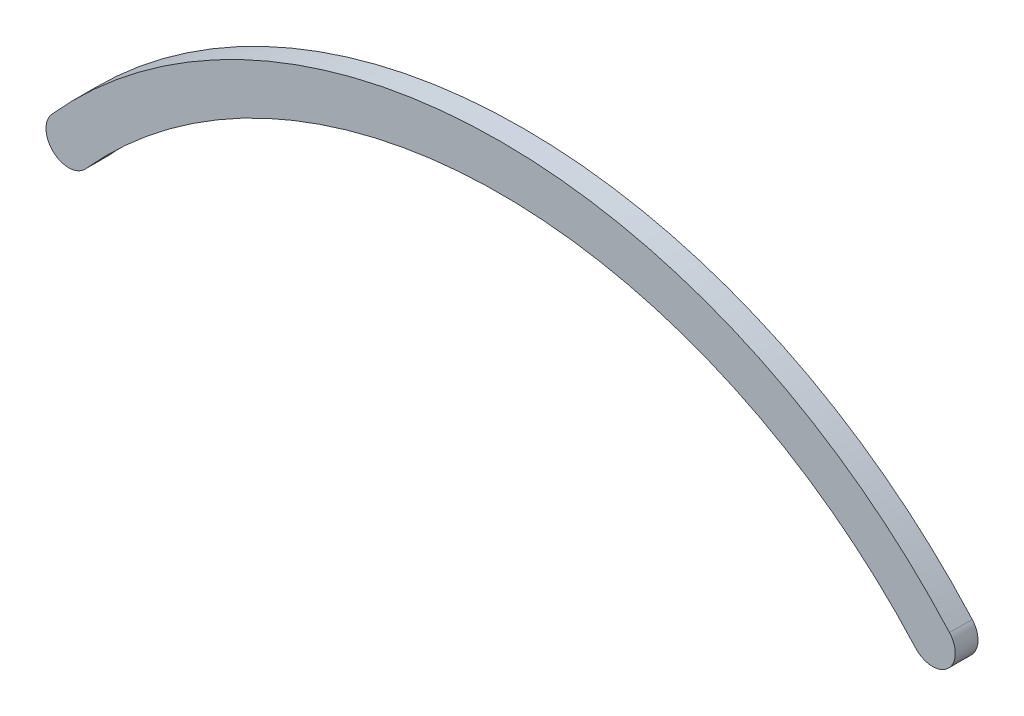
ISO-10303-21;
HEADER;
FILE_DESCRIPTION(('STEP AP214'),'2;1');
FILE_NAME('part.step','',(''),(''),'','','');
FILE_SCHEMA(('AUTOMOTIVE_DESIGN { 1 0 10303 214 1 1 1 1 }'));
ENDSEC;
DATA;
#1=APPLICATION_CONTEXT('core data for automotive mechanical design processes');
#2=APPLICATION_PROTOCOL_DEFINITION('international standard','automotive_design',2000,#1);
#3=PRODUCT_CONTEXT('',#1,'mechanical');
#4=PRODUCT('Part','Part','',(#3));
#5=PRODUCT_RELATED_PRODUCT_CATEGORY('part','',(#4));
#6=PRODUCT_DEFINITION_FORMATION('','',#4);
#7=PRODUCT_DEFINITION_CONTEXT('part definition',#1,'design');
#8=PRODUCT_DEFINITION('design','',#6,#7);
#9=PRODUCT_DEFINITION_SHAPE('','',#8);
#10=(LENGTH_UNIT() NAMED_UNIT(*) SI_UNIT(.MILLI.,.METRE.));
#11=(NAMED_UNIT(*) PLANE_ANGLE_UNIT() SI_UNIT($,.RADIAN.));
#12=(NAMED_UNIT(*) SI_UNIT($,.STERADIAN.) SOLID_ANGLE_UNIT());
#13=UNCERTAINTY_MEASURE_WITH_UNIT(LENGTH_MEASURE(1.E-05),#10,'distance_accuracy_value','');
#14=(GEOMETRIC_REPRESENTATION_CONTEXT(3) GLOBAL_UNCERTAINTY_ASSIGNED_CONTEXT((#13)) GLOBAL_UNIT_ASSIGNED_CONTEXT((#10,
#11,#12)) REPRESENTATION_CONTEXT('',''));
#15=CARTESIAN_POINT('',(0.,0.,0.));
#16=DIRECTION('',(0.,0.,1.));
#17=DIRECTION('',(1.,0.,0.));
#18=AXIS2_PLACEMENT_3D('',#15,#16,#17);
#19=CARTESIAN_POINT('',(0.,-107.80886642101,6.35));
#20=DIRECTION('',(0.,0.,-1.));
#21=DIRECTION('',(-1.,0.,0.));
#22=AXIS2_PLACEMENT_3D('',#19,#20,#21);
#23=CYLINDRICAL_SURFACE('',#22,168.149796597472);
#24=CARTESIAN_POINT('',(0.,-107.80886642101,0.));
#25=DIRECTION('',(0.,0.,1.));
#26=DIRECTION('',(-1.,0.,0.));
#27=AXIS2_PLACEMENT_3D('',#24,#25,#26);
#28=CIRCLE('',#27,168.149796597472);
#29=CARTESIAN_POINT('',(125.385033764634,4.231070224869,0.));
#30=VERTEX_POINT('',#29);
#31=CARTESIAN_POINT('',(-125.385033764634,4.23107022486894,0.));
#32=VERTEX_POINT('',#31);
#33=EDGE_CURVE('E95',#30,#32,#28,.T.);
#34=ORIENTED_EDGE('',*,*,#33,.T.);
#35=DIRECTION('',(0.,0.,-1.));
#36=VECTOR('',#35,1.);
#37=CARTESIAN_POINT('',(-125.385033764634,4.23107022486894,6.35));
#38=LINE('',#37,#36);
#39=CARTESIAN_POINT('',(-125.385033764634,4.23107022486894,6.35));
#40=VERTEX_POINT('',#39);
#41=EDGE_CURVE('E11',#40,#32,#38,.T.);
#42=ORIENTED_EDGE('',*,*,#41,.F.);
#43=CARTESIAN_POINT('',(0.,-107.80886642101,6.35));
#44=DIRECTION('',(0.,0.,1.));
#45=DIRECTION('',(-1.,0.,0.));
#46=AXIS2_PLACEMENT_3D('',#43,#44,#45);
#47=CIRCLE('',#46,168.149796597472);
#48=CARTESIAN_POINT('',(125.385033764634,4.231070224869,6.35));
#49=VERTEX_POINT('',#48);
#50=EDGE_CURVE('E83',#49,#40,#47,.T.);
#51=ORIENTED_EDGE('',*,*,#50,.F.);
#52=DIRECTION('',(0.,0.,-1.));
#53=VECTOR('',#52,1.);
#54=CARTESIAN_POINT('',(125.385033764634,4.231070224869,6.35));
#55=LINE('',#54,#53);
#56=EDGE_CURVE('E91',#49,#30,#55,.T.);
#57=ORIENTED_EDGE('',*,*,#56,.T.);
#58=EDGE_LOOP('',(#34,#42,#51,#57));
#59=FACE_BOUND('',#58,.T.);
#60=ADVANCED_FACE('F32',(#59),#23,.T.);
#61=CARTESIAN_POINT('',(-120.65,0.,6.35));
#62=DIRECTION('',(0.,0.,-1.));
#63=DIRECTION('',(-1.,0.,0.));
#64=AXIS2_PLACEMENT_3D('',#61,#62,#63);
#65=CYLINDRICAL_SURFACE('',#64,6.34999999999999);
#66=CARTESIAN_POINT('',(-120.65,0.,0.));
#67=DIRECTION('',(0.,0.,1.));
#68=DIRECTION('',(1.,0.,0.));
#69=AXIS2_PLACEMENT_3D('',#66,#67,#68);
#70=CIRCLE('',#69,6.34999999999999);
#71=CARTESIAN_POINT('',(-115.913440576864,-4.22936222510033,0.));
#72=VERTEX_POINT('',#71);
#73=EDGE_CURVE('E87',#32,#72,#70,.T.);
#74=ORIENTED_EDGE('',*,*,#73,.T.);
#75=DIRECTION('',(0.,0.,-1.));
#76=VECTOR('',#75,1.);
#77=CARTESIAN_POINT('',(-115.913440576864,-4.22936222510033,6.35));
#78=LINE('',#77,#76);
#79=CARTESIAN_POINT('',(-115.913440576864,-4.22936222510033,6.35));
#80=VERTEX_POINT('',#79);
#81=EDGE_CURVE('E40',#80,#72,#78,.T.);
#82=ORIENTED_EDGE('',*,*,#81,.F.);
#83=CARTESIAN_POINT('',(-120.65,0.,6.35));
#84=DIRECTION('',(0.,0.,1.));
#85=DIRECTION('',(1.,0.,0.));
#86=AXIS2_PLACEMENT_3D('',#83,#84,#85);
#87=CIRCLE('',#86,6.34999999999999);
#88=EDGE_CURVE('E78',#40,#80,#87,.T.);
#89=ORIENTED_EDGE('',*,*,#88,.F.);
#90=ORIENTED_EDGE('',*,*,#41,.T.);
#91=EDGE_LOOP('',(#74,#82,#89,#90));
#92=FACE_BOUND('',#91,.T.);
#93=ADVANCED_FACE('F86',(#92),#65,.T.);
#94=CARTESIAN_POINT('',(0.,-107.730634596485,6.35));
#95=DIRECTION('',(0.,0.,-1.));
#96=DIRECTION('',(-1.,0.,0.));
#97=AXIS2_PLACEMENT_3D('',#94,#95,#96);
#98=CYLINDRICAL_SURFACE('',#97,155.397680448782);
#99=CARTESIAN_POINT('',(0.,-107.730634596485,0.));
#100=DIRECTION('',(0.,0.,-1.));
#101=DIRECTION('',(-1.,0.,0.));
#102=AXIS2_PLACEMENT_3D('',#99,#100,#101);
#103=CIRCLE('',#102,155.397680448782);
#104=CARTESIAN_POINT('',(115.913440576864,-4.22936222510031,0.));
#105=VERTEX_POINT('',#104);
#106=EDGE_CURVE('E65',#72,#105,#103,.T.);
#107=ORIENTED_EDGE('',*,*,#106,.T.);
#108=DIRECTION('',(0.,0.,-1.));
#109=VECTOR('',#108,1.);
#110=CARTESIAN_POINT('',(115.913440576864,-4.22936222510031,6.35));
#111=LINE('',#110,#109);
#112=CARTESIAN_POINT('',(115.913440576864,-4.22936222510031,6.35));
#113=VERTEX_POINT('',#112);
#114=EDGE_CURVE('E88',#113,#105,#111,.T.);
#115=ORIENTED_EDGE('',*,*,#114,.F.);
#116=CARTESIAN_POINT('',(0.,-107.730634596485,6.35));
#117=DIRECTION('',(0.,0.,-1.));
#118=DIRECTION('',(-1.,0.,0.));
#119=AXIS2_PLACEMENT_3D('',#116,#117,#118);
#120=CIRCLE('',#119,155.397680448782);
#121=EDGE_CURVE('E81',#80,#113,#120,.T.);
#122=ORIENTED_EDGE('',*,*,#121,.F.);
#123=ORIENTED_EDGE('',*,*,#81,.T.);
#124=EDGE_LOOP('',(#107,#115,#122,#123));
#125=FACE_BOUND('',#124,.T.);
#126=ADVANCED_FACE('F89',(#125),#98,.F.);
#127=CARTESIAN_POINT('',(120.65,0.,6.35));
#128=DIRECTION('',(0.,0.,-1.));
#129=DIRECTION('',(-1.,0.,0.));
#130=AXIS2_PLACEMENT_3D('',#127,#128,#129);
#131=CYLINDRICAL_SURFACE('',#130,6.35000000000001);
#132=CARTESIAN_POINT('',(120.65,0.,0.));
#133=DIRECTION('',(0.,0.,1.));
#134=DIRECTION('',(1.,0.,0.));
#135=AXIS2_PLACEMENT_3D('',#132,#133,#134);
#136=CIRCLE('',#135,6.35000000000001);
#137=EDGE_CURVE('E71',#105,#30,#136,.T.);
#138=ORIENTED_EDGE('',*,*,#137,.T.);
#139=ORIENTED_EDGE('',*,*,#56,.F.);
#140=CARTESIAN_POINT('',(120.65,0.,6.35));
#141=DIRECTION('',(0.,0.,1.));
#142=DIRECTION('',(1.,0.,0.));
#143=AXIS2_PLACEMENT_3D('',#140,#141,#142);
#144=CIRCLE('',#143,6.35000000000001);
#145=EDGE_CURVE('E48',#113,#49,#144,.T.);
#146=ORIENTED_EDGE('',*,*,#145,.F.);
#147=ORIENTED_EDGE('',*,*,#114,.T.);
#148=EDGE_LOOP('',(#138,#139,#146,#147));
#149=FACE_BOUND('',#148,.T.);
#150=ADVANCED_FACE('F102',(#149),#131,.T.);
#151=CARTESIAN_POINT('',(60.325,-53.904433210505,6.35));
#152=DIRECTION('',(0.,0.,-1.));
#153=DIRECTION('',(-1.,0.,0.));
#154=AXIS2_PLACEMENT_3D('',#151,#152,#153);
#155=PLANE('',#154);
#156=ORIENTED_EDGE('',*,*,#50,.T.);
#157=ORIENTED_EDGE('',*,*,#88,.T.);
#158=ORIENTED_EDGE('',*,*,#121,.T.);
#159=ORIENTED_EDGE('',*,*,#145,.T.);
#160=EDGE_LOOP('',(#156,#157,#158,#159));
#161=FACE_BOUND('',#160,.T.);
#162=ADVANCED_FACE('F79',(#161),#155,.F.);
#163=CARTESIAN_POINT('',(60.325,-53.904433210505,0.));
#164=DIRECTION('',(0.,0.,-1.));
#165=DIRECTION('',(-1.,0.,0.));
#166=AXIS2_PLACEMENT_3D('',#163,#164,#165);
#167=PLANE('',#166);
#168=ORIENTED_EDGE('',*,*,#33,.F.);
#169=ORIENTED_EDGE('',*,*,#137,.F.);
#170=ORIENTED_EDGE('',*,*,#106,.F.);
#171=ORIENTED_EDGE('',*,*,#73,.F.);
#172=EDGE_LOOP('',(#168,#169,#170,#171));
#173=FACE_BOUND('',#172,.T.);
#174=ADVANCED_FACE('F105',(#173),#167,.T.);
#175=CLOSED_SHELL('',(#60,#93,#126,#150,#162,#174));
#176=MANIFOLD_SOLID_BREP('B2',#175);
#177=ADVANCED_BREP_SHAPE_REPRESENTATION('',(#18,#176),#14);
#178=SHAPE_DEFINITION_REPRESENTATION(#9,#177);
ENDSEC;
END-ISO-10303-21;
